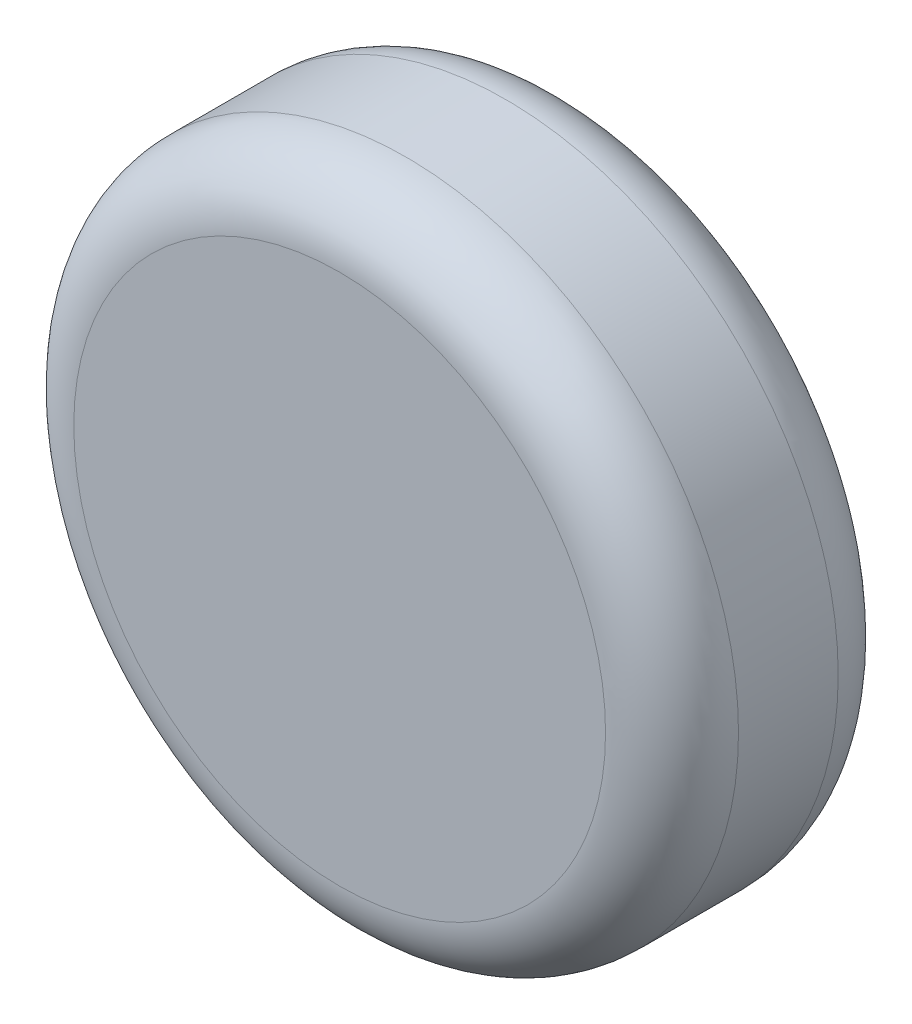
ISO-10303-21;
HEADER;
FILE_DESCRIPTION(('STEP AP214'),'2;1');
FILE_NAME('part.step','',(''),(''),'','','');
FILE_SCHEMA(('AUTOMOTIVE_DESIGN { 1 0 10303 214 1 1 1 1 }'));
ENDSEC;
DATA;
#1=APPLICATION_CONTEXT('core data for automotive mechanical design processes');
#2=APPLICATION_PROTOCOL_DEFINITION('international standard','automotive_design',2000,#1);
#3=PRODUCT_CONTEXT('',#1,'mechanical');
#4=PRODUCT('Part','Part','',(#3));
#5=PRODUCT_RELATED_PRODUCT_CATEGORY('part','',(#4));
#6=PRODUCT_DEFINITION_FORMATION('','',#4);
#7=PRODUCT_DEFINITION_CONTEXT('part definition',#1,'design');
#8=PRODUCT_DEFINITION('design','',#6,#7);
#9=PRODUCT_DEFINITION_SHAPE('','',#8);
#10=(LENGTH_UNIT() NAMED_UNIT(*) SI_UNIT(.MILLI.,.METRE.));
#11=(NAMED_UNIT(*) PLANE_ANGLE_UNIT() SI_UNIT($,.RADIAN.));
#12=(NAMED_UNIT(*) SI_UNIT($,.STERADIAN.) SOLID_ANGLE_UNIT());
#13=UNCERTAINTY_MEASURE_WITH_UNIT(LENGTH_MEASURE(1.E-05),#10,'distance_accuracy_value','');
#14=(GEOMETRIC_REPRESENTATION_CONTEXT(3) GLOBAL_UNCERTAINTY_ASSIGNED_CONTEXT((#13)) GLOBAL_UNIT_ASSIGNED_CONTEXT((#10,
#11,#12)) REPRESENTATION_CONTEXT('',''));
#15=CARTESIAN_POINT('',(0.,0.,0.));
#16=DIRECTION('',(0.,0.,1.));
#17=DIRECTION('',(1.,0.,0.));
#18=AXIS2_PLACEMENT_3D('',#15,#16,#17);
#19=CARTESIAN_POINT('',(0.,0.,8.89));
#20=DIRECTION('',(0.,0.,-1.));
#21=DIRECTION('',(-1.,0.,0.));
#22=AXIS2_PLACEMENT_3D('',#19,#20,#21);
#23=CYLINDRICAL_SURFACE('',#22,12.7);
#24=CARTESIAN_POINT('',(0.,0.,2.54));
#25=DIRECTION('',(0.,0.,1.));
#26=DIRECTION('',(1.,0.,0.));
#27=AXIS2_PLACEMENT_3D('',#24,#25,#26);
#28=CIRCLE('',#27,12.7);
#29=CARTESIAN_POINT('',(12.7,0.,2.54));
#30=VERTEX_POINT('',#29);
#31=EDGE_CURVE('E54',#30,#30,#28,.T.);
#32=ORIENTED_EDGE('',*,*,#31,.T.);
#33=EDGE_LOOP('',(#32));
#34=FACE_BOUND('',#33,.T.);
#35=CARTESIAN_POINT('',(0.,0.,6.35));
#36=DIRECTION('',(0.,0.,1.));
#37=DIRECTION('',(1.,0.,0.));
#38=AXIS2_PLACEMENT_3D('',#35,#36,#37);
#39=CIRCLE('',#38,12.7);
#40=CARTESIAN_POINT('',(12.7,0.,6.35));
#41=VERTEX_POINT('',#40);
#42=EDGE_CURVE('E59',#41,#41,#39,.F.);
#43=ORIENTED_EDGE('',*,*,#42,.T.);
#44=EDGE_LOOP('',(#43));
#45=FACE_BOUND('',#44,.T.);
#46=ADVANCED_FACE('F41',(#34,#45),#23,.T.);
#47=CARTESIAN_POINT('',(0.,0.,8.89));
#48=DIRECTION('',(0.,0.,1.));
#49=DIRECTION('',(1.,0.,0.));
#50=AXIS2_PLACEMENT_3D('',#47,#48,#49);
#51=PLANE('',#50);
#52=CARTESIAN_POINT('',(0.,0.,8.89));
#53=DIRECTION('',(0.,0.,1.));
#54=DIRECTION('',(1.,0.,0.));
#55=AXIS2_PLACEMENT_3D('',#52,#53,#54);
#56=CIRCLE('',#55,10.16);
#57=CARTESIAN_POINT('',(10.16,0.,8.89));
#58=VERTEX_POINT('',#57);
#59=EDGE_CURVE('E10',#58,#58,#56,.T.);
#60=ORIENTED_EDGE('',*,*,#59,.T.);
#61=EDGE_LOOP('',(#60));
#62=FACE_BOUND('',#61,.T.);
#63=ADVANCED_FACE('F84',(#62),#51,.T.);
#64=CARTESIAN_POINT('',(0.,0.,0.));
#65=DIRECTION('',(0.,0.,1.));
#66=DIRECTION('',(1.,0.,0.));
#67=AXIS2_PLACEMENT_3D('',#64,#65,#66);
#68=PLANE('',#67);
#69=CARTESIAN_POINT('',(0.,0.,0.));
#70=DIRECTION('',(0.,0.,1.));
#71=DIRECTION('',(1.,0.,0.));
#72=AXIS2_PLACEMENT_3D('',#69,#70,#71);
#73=CIRCLE('',#72,10.16);
#74=CARTESIAN_POINT('',(10.16,0.,0.));
#75=VERTEX_POINT('',#74);
#76=EDGE_CURVE('E49',#75,#75,#73,.F.);
#77=ORIENTED_EDGE('',*,*,#76,.T.);
#78=EDGE_LOOP('',(#77));
#79=FACE_BOUND('',#78,.T.);
#80=CARTESIAN_POINT('',(0.,0.,0.));
#81=DIRECTION('',(0.,0.,-1.));
#82=DIRECTION('',(-1.,0.,0.));
#83=AXIS2_PLACEMENT_3D('',#80,#81,#82);
#84=CIRCLE('',#83,2.54);
#85=CARTESIAN_POINT('',(-2.54,0.,0.));
#86=VERTEX_POINT('',#85);
#87=EDGE_CURVE('E66',#86,#86,#84,.T.);
#88=ORIENTED_EDGE('',*,*,#87,.F.);
#89=EDGE_LOOP('',(#88));
#90=FACE_BOUND('',#89,.T.);
#91=ADVANCED_FACE('F79',(#79,#90),#68,.F.);
#92=CARTESIAN_POINT('',(0.,0.,6.35));
#93=DIRECTION('',(0.,0.,-1.));
#94=DIRECTION('',(-1.,0.,0.));
#95=AXIS2_PLACEMENT_3D('',#92,#93,#94);
#96=CYLINDRICAL_SURFACE('',#95,2.54);
#97=CARTESIAN_POINT('',(0.,0.,6.35));
#98=DIRECTION('',(0.,0.,-1.));
#99=DIRECTION('',(-1.,0.,0.));
#100=AXIS2_PLACEMENT_3D('',#97,#98,#99);
#101=CIRCLE('',#100,2.54);
#102=CARTESIAN_POINT('',(-2.54,0.,6.35));
#103=VERTEX_POINT('',#102);
#104=EDGE_CURVE('E65',#103,#103,#101,.T.);
#105=ORIENTED_EDGE('',*,*,#104,.F.);
#106=EDGE_LOOP('',(#105));
#107=FACE_BOUND('',#106,.T.);
#108=ORIENTED_EDGE('',*,*,#87,.T.);
#109=EDGE_LOOP('',(#108));
#110=FACE_BOUND('',#109,.T.);
#111=ADVANCED_FACE('F76',(#107,#110),#96,.F.);
#112=CARTESIAN_POINT('',(0.,0.,6.35));
#113=DIRECTION('',(0.,0.,-1.));
#114=DIRECTION('',(-1.,0.,0.));
#115=AXIS2_PLACEMENT_3D('',#112,#113,#114);
#116=PLANE('',#115);
#117=ORIENTED_EDGE('',*,*,#104,.T.);
#118=EDGE_LOOP('',(#117));
#119=FACE_BOUND('',#118,.T.);
#120=ADVANCED_FACE('F74',(#119),#116,.T.);
#121=CARTESIAN_POINT('',(0.,0.,2.54));
#122=DIRECTION('',(0.,0.,1.));
#123=DIRECTION('',(1.,0.,0.));
#124=AXIS2_PLACEMENT_3D('',#121,#122,#123);
#125=TOROIDAL_SURFACE('',#124,10.16,2.54);
#126=ORIENTED_EDGE('',*,*,#76,.F.);
#127=EDGE_LOOP('',(#126));
#128=FACE_BOUND('',#127,.T.);
#129=ORIENTED_EDGE('',*,*,#31,.F.);
#130=EDGE_LOOP('',(#129));
#131=FACE_BOUND('',#130,.T.);
#132=ADVANCED_FACE('F96',(#128,#131),#125,.T.);
#133=CARTESIAN_POINT('',(0.,0.,6.35));
#134=DIRECTION('',(0.,0.,1.));
#135=DIRECTION('',(1.,0.,0.));
#136=AXIS2_PLACEMENT_3D('',#133,#134,#135);
#137=TOROIDAL_SURFACE('',#136,10.16,2.54);
#138=ORIENTED_EDGE('',*,*,#42,.F.);
#139=EDGE_LOOP('',(#138));
#140=FACE_BOUND('',#139,.T.);
#141=ORIENTED_EDGE('',*,*,#59,.F.);
#142=EDGE_LOOP('',(#141));
#143=FACE_BOUND('',#142,.T.);
#144=ADVANCED_FACE('F43',(#140,#143),#137,.T.);
#145=CLOSED_SHELL('',(#46,#63,#91,#111,#120,#132,#144));
#146=MANIFOLD_SOLID_BREP('B2',#145);
#147=ADVANCED_BREP_SHAPE_REPRESENTATION('',(#18,#146),#14);
#148=SHAPE_DEFINITION_REPRESENTATION(#9,#147);
ENDSEC;
END-ISO-10303-21;
